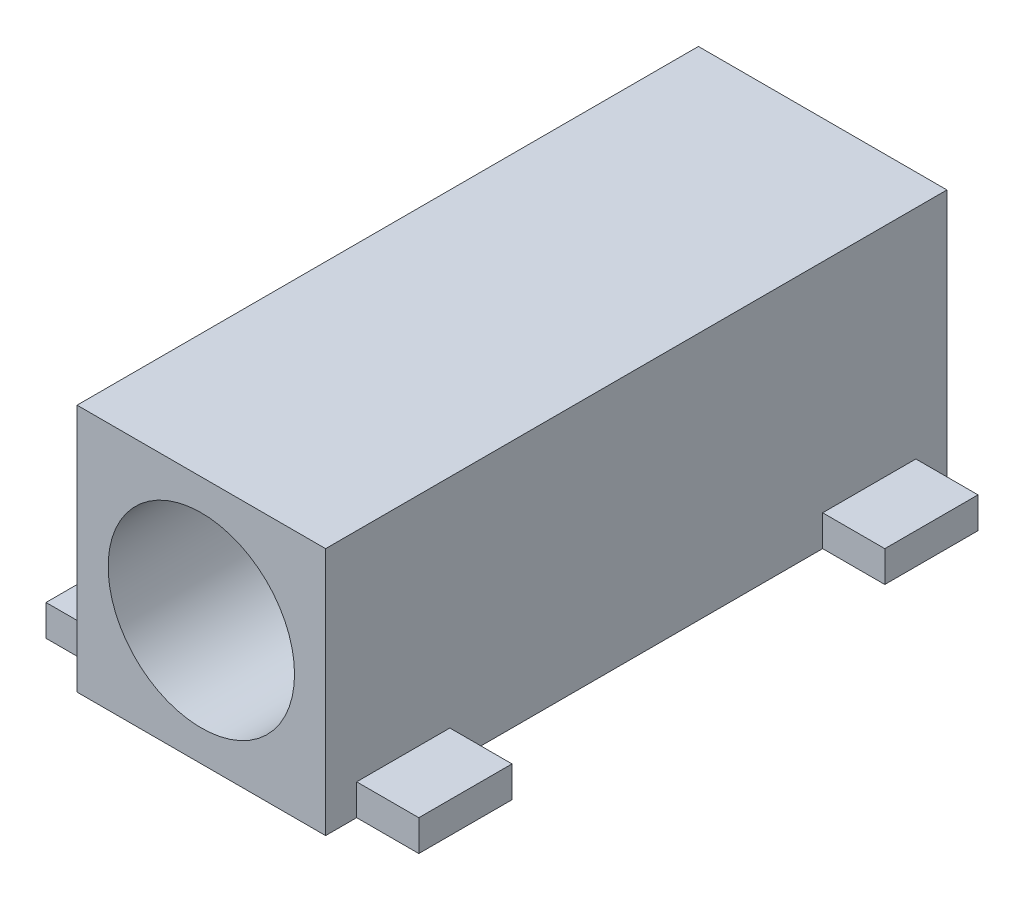
ISO-10303-21;
HEADER;
FILE_DESCRIPTION(('STEP AP214'),'2;1');
FILE_NAME('part.step','',(''),(''),'','','');
FILE_SCHEMA(('AUTOMOTIVE_DESIGN { 1 0 10303 214 1 1 1 1 }'));
ENDSEC;
DATA;
#1=APPLICATION_CONTEXT('core data for automotive mechanical design processes');
#2=APPLICATION_PROTOCOL_DEFINITION('international standard','automotive_design',2000,#1);
#3=PRODUCT_CONTEXT('',#1,'mechanical');
#4=PRODUCT('Part','Part','',(#3));
#5=PRODUCT_RELATED_PRODUCT_CATEGORY('part','',(#4));
#6=PRODUCT_DEFINITION_FORMATION('','',#4);
#7=PRODUCT_DEFINITION_CONTEXT('part definition',#1,'design');
#8=PRODUCT_DEFINITION('design','',#6,#7);
#9=PRODUCT_DEFINITION_SHAPE('','',#8);
#10=(LENGTH_UNIT() NAMED_UNIT(*) SI_UNIT(.MILLI.,.METRE.));
#11=(NAMED_UNIT(*) PLANE_ANGLE_UNIT() SI_UNIT($,.RADIAN.));
#12=(NAMED_UNIT(*) SI_UNIT($,.STERADIAN.) SOLID_ANGLE_UNIT());
#13=UNCERTAINTY_MEASURE_WITH_UNIT(LENGTH_MEASURE(1.E-05),#10,'distance_accuracy_value','');
#14=(GEOMETRIC_REPRESENTATION_CONTEXT(3) GLOBAL_UNCERTAINTY_ASSIGNED_CONTEXT((#13)) GLOBAL_UNIT_ASSIGNED_CONTEXT((#10,
#11,#12)) REPRESENTATION_CONTEXT('',''));
#15=CARTESIAN_POINT('',(0.,0.,0.));
#16=DIRECTION('',(0.,0.,1.));
#17=DIRECTION('',(1.,0.,0.));
#18=AXIS2_PLACEMENT_3D('',#15,#16,#17);
#19=CARTESIAN_POINT('',(-2.,2.,10.));
#20=DIRECTION('',(1.,0.,0.));
#21=DIRECTION('',(0.,0.,-1.));
#22=AXIS2_PLACEMENT_3D('',#19,#20,#21);
#23=PLANE('',#22);
#24=DIRECTION('',(0.,1.,0.));
#25=VECTOR('',#24,1.);
#26=CARTESIAN_POINT('',(-2.,-2.,9.5));
#27=LINE('',#26,#25);
#28=CARTESIAN_POINT('',(-2.,-2.,9.5));
#29=VERTEX_POINT('',#28);
#30=CARTESIAN_POINT('',(-2.,-1.5,9.5));
#31=VERTEX_POINT('',#30);
#32=EDGE_CURVE('E167',#29,#31,#27,.T.);
#33=ORIENTED_EDGE('',*,*,#32,.F.);
#34=DIRECTION('',(0.,0.,-1.));
#35=VECTOR('',#34,1.);
#36=CARTESIAN_POINT('',(-2.,-2.,10.));
#37=LINE('',#36,#35);
#38=CARTESIAN_POINT('',(-2.,-2.,10.));
#39=VERTEX_POINT('',#38);
#40=EDGE_CURVE('E11',#39,#29,#37,.T.);
#41=ORIENTED_EDGE('',*,*,#40,.F.);
#42=DIRECTION('',(0.,-1.,0.));
#43=VECTOR('',#42,1.);
#44=CARTESIAN_POINT('',(-2.,2.,10.));
#45=LINE('',#44,#43);
#46=CARTESIAN_POINT('',(-2.,2.,10.));
#47=VERTEX_POINT('',#46);
#48=EDGE_CURVE('E288',#47,#39,#45,.T.);
#49=ORIENTED_EDGE('',*,*,#48,.F.);
#50=DIRECTION('',(0.,0.,-1.));
#51=VECTOR('',#50,1.);
#52=CARTESIAN_POINT('',(-2.,2.,10.));
#53=LINE('',#52,#51);
#54=CARTESIAN_POINT('',(-2.,2.,0.));
#55=VERTEX_POINT('',#54);
#56=EDGE_CURVE('E283',#47,#55,#53,.T.);
#57=ORIENTED_EDGE('',*,*,#56,.T.);
#58=DIRECTION('',(0.,-1.,0.));
#59=VECTOR('',#58,1.);
#60=CARTESIAN_POINT('',(-2.,2.,0.));
#61=LINE('',#60,#59);
#62=CARTESIAN_POINT('',(-2.,-2.,0.));
#63=VERTEX_POINT('',#62);
#64=EDGE_CURVE('E287',#55,#63,#61,.T.);
#65=ORIENTED_EDGE('',*,*,#64,.T.);
#66=CARTESIAN_POINT('',(-2.,-2.,8.));
#67=VERTEX_POINT('',#66);
#68=EDGE_CURVE('E41',#67,#63,#37,.T.);
#69=ORIENTED_EDGE('',*,*,#68,.F.);
#70=DIRECTION('',(0.,-1.,0.));
#71=VECTOR('',#70,1.);
#72=CARTESIAN_POINT('',(-2.,-2.,8.));
#73=LINE('',#72,#71);
#74=CARTESIAN_POINT('',(-2.,-1.5,8.));
#75=VERTEX_POINT('',#74);
#76=EDGE_CURVE('E164',#75,#67,#73,.T.);
#77=ORIENTED_EDGE('',*,*,#76,.F.);
#78=DIRECTION('',(0.,0.,-1.));
#79=VECTOR('',#78,1.);
#80=CARTESIAN_POINT('',(-2.,-1.5,9.5));
#81=LINE('',#80,#79);
#82=EDGE_CURVE('E49',#31,#75,#81,.T.);
#83=ORIENTED_EDGE('',*,*,#82,.F.);
#84=EDGE_LOOP('',(#33,#41,#49,#57,#65,#69,#77,#83));
#85=FACE_BOUND('',#84,.T.);
#86=ADVANCED_FACE('F33',(#85),#23,.F.);
#87=CARTESIAN_POINT('',(2.,2.,10.));
#88=DIRECTION('',(-1.,0.,0.));
#89=DIRECTION('',(0.,0.,1.));
#90=AXIS2_PLACEMENT_3D('',#87,#88,#89);
#91=PLANE('',#90);
#92=DIRECTION('',(0.,-1.,0.));
#93=VECTOR('',#92,1.);
#94=CARTESIAN_POINT('',(2.,-2.,2.));
#95=LINE('',#94,#93);
#96=CARTESIAN_POINT('',(2.,-1.5,2.));
#97=VERTEX_POINT('',#96);
#98=CARTESIAN_POINT('',(2.,-2.,2.));
#99=VERTEX_POINT('',#98);
#100=EDGE_CURVE('E168',#97,#99,#95,.T.);
#101=ORIENTED_EDGE('',*,*,#100,.F.);
#102=DIRECTION('',(0.,0.,1.));
#103=VECTOR('',#102,1.);
#104=CARTESIAN_POINT('',(2.,-1.5,2.));
#105=LINE('',#104,#103);
#106=CARTESIAN_POINT('',(2.,-1.5,0.5));
#107=VERTEX_POINT('',#106);
#108=EDGE_CURVE('E181',#107,#97,#105,.T.);
#109=ORIENTED_EDGE('',*,*,#108,.F.);
#110=DIRECTION('',(0.,1.,0.));
#111=VECTOR('',#110,1.);
#112=CARTESIAN_POINT('',(2.,-2.,0.5));
#113=LINE('',#112,#111);
#114=CARTESIAN_POINT('',(2.,-2.,0.5));
#115=VERTEX_POINT('',#114);
#116=EDGE_CURVE('E171',#115,#107,#113,.T.);
#117=ORIENTED_EDGE('',*,*,#116,.F.);
#118=DIRECTION('',(0.,0.,-1.));
#119=VECTOR('',#118,1.);
#120=CARTESIAN_POINT('',(2.,-2.,10.));
#121=LINE('',#120,#119);
#122=CARTESIAN_POINT('',(2.,-2.,0.));
#123=VERTEX_POINT('',#122);
#124=EDGE_CURVE('E225',#115,#123,#121,.T.);
#125=ORIENTED_EDGE('',*,*,#124,.T.);
#126=DIRECTION('',(0.,1.,0.));
#127=VECTOR('',#126,1.);
#128=CARTESIAN_POINT('',(2.,2.,0.));
#129=LINE('',#128,#127);
#130=CARTESIAN_POINT('',(2.,2.,0.));
#131=VERTEX_POINT('',#130);
#132=EDGE_CURVE('E271',#123,#131,#129,.T.);
#133=ORIENTED_EDGE('',*,*,#132,.T.);
#134=DIRECTION('',(0.,0.,-1.));
#135=VECTOR('',#134,1.);
#136=CARTESIAN_POINT('',(2.,2.,10.));
#137=LINE('',#136,#135);
#138=CARTESIAN_POINT('',(2.,2.,10.));
#139=VERTEX_POINT('',#138);
#140=EDGE_CURVE('E228',#139,#131,#137,.T.);
#141=ORIENTED_EDGE('',*,*,#140,.F.);
#142=DIRECTION('',(0.,1.,0.));
#143=VECTOR('',#142,1.);
#144=CARTESIAN_POINT('',(2.,2.,10.));
#145=LINE('',#144,#143);
#146=CARTESIAN_POINT('',(2.,-2.,10.));
#147=VERTEX_POINT('',#146);
#148=EDGE_CURVE('E295',#147,#139,#145,.T.);
#149=ORIENTED_EDGE('',*,*,#148,.F.);
#150=CARTESIAN_POINT('',(2.,-2.,9.5));
#151=VERTEX_POINT('',#150);
#152=EDGE_CURVE('E240',#147,#151,#121,.T.);
#153=ORIENTED_EDGE('',*,*,#152,.T.);
#154=DIRECTION('',(0.,-1.,0.));
#155=VECTOR('',#154,1.);
#156=CARTESIAN_POINT('',(2.,-2.,9.5));
#157=LINE('',#156,#155);
#158=CARTESIAN_POINT('',(2.,-1.5,9.5));
#159=VERTEX_POINT('',#158);
#160=EDGE_CURVE('E203',#159,#151,#157,.T.);
#161=ORIENTED_EDGE('',*,*,#160,.F.);
#162=DIRECTION('',(0.,0.,1.));
#163=VECTOR('',#162,1.);
#164=CARTESIAN_POINT('',(2.,-1.5,9.5));
#165=LINE('',#164,#163);
#166=CARTESIAN_POINT('',(2.,-1.5,8.));
#167=VERTEX_POINT('',#166);
#168=EDGE_CURVE('E208',#167,#159,#165,.T.);
#169=ORIENTED_EDGE('',*,*,#168,.F.);
#170=DIRECTION('',(0.,1.,0.));
#171=VECTOR('',#170,1.);
#172=CARTESIAN_POINT('',(2.,-2.,8.));
#173=LINE('',#172,#171);
#174=CARTESIAN_POINT('',(2.,-2.,8.));
#175=VERTEX_POINT('',#174);
#176=EDGE_CURVE('E222',#175,#167,#173,.T.);
#177=ORIENTED_EDGE('',*,*,#176,.F.);
#178=EDGE_CURVE('E227',#175,#99,#121,.T.);
#179=ORIENTED_EDGE('',*,*,#178,.T.);
#180=EDGE_LOOP('',(#101,#109,#117,#125,#133,#141,#149,#153,#161,#169,#177,#179));
#181=FACE_BOUND('',#180,.T.);
#182=ADVANCED_FACE('F246',(#181),#91,.F.);
#183=CARTESIAN_POINT('',(0.,0.,10.));
#184=DIRECTION('',(0.,0.,1.));
#185=DIRECTION('',(1.,0.,0.));
#186=AXIS2_PLACEMENT_3D('',#183,#184,#185);
#187=PLANE('',#186);
#188=ORIENTED_EDGE('',*,*,#48,.T.);
#189=DIRECTION('',(1.,0.,0.));
#190=VECTOR('',#189,1.);
#191=CARTESIAN_POINT('',(-2.,-2.,10.));
#192=LINE('',#191,#190);
#193=EDGE_CURVE('E291',#39,#147,#192,.T.);
#194=ORIENTED_EDGE('',*,*,#193,.T.);
#195=ORIENTED_EDGE('',*,*,#148,.T.);
#196=DIRECTION('',(-1.,0.,0.));
#197=VECTOR('',#196,1.);
#198=CARTESIAN_POINT('',(-2.,2.,10.));
#199=LINE('',#198,#197);
#200=EDGE_CURVE('E282',#139,#47,#199,.T.);
#201=ORIENTED_EDGE('',*,*,#200,.T.);
#202=EDGE_LOOP('',(#188,#194,#195,#201));
#203=FACE_BOUND('',#202,.T.);
#204=CARTESIAN_POINT('',(0.,0.,10.));
#205=DIRECTION('',(0.,0.,1.));
#206=DIRECTION('',(1.,0.,0.));
#207=AXIS2_PLACEMENT_3D('',#204,#205,#206);
#208=CIRCLE('',#207,1.5);
#209=CARTESIAN_POINT('',(1.5,0.,10.));
#210=VERTEX_POINT('',#209);
#211=EDGE_CURVE('E301',#210,#210,#208,.T.);
#212=ORIENTED_EDGE('',*,*,#211,.F.);
#213=EDGE_LOOP('',(#212));
#214=FACE_BOUND('',#213,.T.);
#215=ADVANCED_FACE('F312',(#203,#214),#187,.T.);
#216=CARTESIAN_POINT('',(0.,0.,0.));
#217=DIRECTION('',(0.,0.,1.));
#218=DIRECTION('',(1.,0.,0.));
#219=AXIS2_PLACEMENT_3D('',#216,#217,#218);
#220=PLANE('',#219);
#221=ORIENTED_EDGE('',*,*,#64,.F.);
#222=DIRECTION('',(-1.,0.,0.));
#223=VECTOR('',#222,1.);
#224=CARTESIAN_POINT('',(-2.,2.,0.));
#225=LINE('',#224,#223);
#226=EDGE_CURVE('E276',#131,#55,#225,.T.);
#227=ORIENTED_EDGE('',*,*,#226,.F.);
#228=ORIENTED_EDGE('',*,*,#132,.F.);
#229=DIRECTION('',(1.,0.,0.));
#230=VECTOR('',#229,1.);
#231=CARTESIAN_POINT('',(-2.,-2.,0.));
#232=LINE('',#231,#230);
#233=EDGE_CURVE('E268',#63,#123,#232,.T.);
#234=ORIENTED_EDGE('',*,*,#233,.F.);
#235=EDGE_LOOP('',(#221,#227,#228,#234));
#236=FACE_BOUND('',#235,.T.);
#237=CARTESIAN_POINT('',(0.,0.,0.));
#238=DIRECTION('',(0.,0.,1.));
#239=DIRECTION('',(1.,0.,0.));
#240=AXIS2_PLACEMENT_3D('',#237,#238,#239);
#241=CIRCLE('',#240,1.5);
#242=CARTESIAN_POINT('',(1.5,0.,0.));
#243=VERTEX_POINT('',#242);
#244=EDGE_CURVE('E303',#243,#243,#241,.T.);
#245=ORIENTED_EDGE('',*,*,#244,.T.);
#246=EDGE_LOOP('',(#245));
#247=FACE_BOUND('',#246,.T.);
#248=ADVANCED_FACE('F285',(#236,#247),#220,.F.);
#249=CARTESIAN_POINT('',(-2.,-2.,10.));
#250=DIRECTION('',(0.,1.,0.));
#251=DIRECTION('',(0.,0.,1.));
#252=AXIS2_PLACEMENT_3D('',#249,#250,#251);
#253=PLANE('',#252);
#254=ORIENTED_EDGE('',*,*,#233,.T.);
#255=ORIENTED_EDGE('',*,*,#124,.F.);
#256=DIRECTION('',(-1.,0.,0.));
#257=VECTOR('',#256,1.);
#258=CARTESIAN_POINT('',(3.,-2.,0.5));
#259=LINE('',#258,#257);
#260=CARTESIAN_POINT('',(3.,-2.,0.5));
#261=VERTEX_POINT('',#260);
#262=EDGE_CURVE('E197',#261,#115,#259,.T.);
#263=ORIENTED_EDGE('',*,*,#262,.F.);
#264=DIRECTION('',(0.,0.,-1.));
#265=VECTOR('',#264,1.);
#266=CARTESIAN_POINT('',(3.,-2.,2.));
#267=LINE('',#266,#265);
#268=CARTESIAN_POINT('',(3.,-2.,2.));
#269=VERTEX_POINT('',#268);
#270=EDGE_CURVE('E180',#269,#261,#267,.T.);
#271=ORIENTED_EDGE('',*,*,#270,.F.);
#272=DIRECTION('',(-1.,0.,0.));
#273=VECTOR('',#272,1.);
#274=CARTESIAN_POINT('',(3.,-2.,2.));
#275=LINE('',#274,#273);
#276=EDGE_CURVE('E200',#269,#99,#275,.T.);
#277=ORIENTED_EDGE('',*,*,#276,.T.);
#278=ORIENTED_EDGE('',*,*,#178,.F.);
#279=DIRECTION('',(-1.,0.,0.));
#280=VECTOR('',#279,1.);
#281=CARTESIAN_POINT('',(3.,-2.,8.));
#282=LINE('',#281,#280);
#283=CARTESIAN_POINT('',(3.,-2.,8.));
#284=VERTEX_POINT('',#283);
#285=EDGE_CURVE('E318',#284,#175,#282,.T.);
#286=ORIENTED_EDGE('',*,*,#285,.F.);
#287=DIRECTION('',(0.,0.,-1.));
#288=VECTOR('',#287,1.);
#289=CARTESIAN_POINT('',(3.,-2.,9.5));
#290=LINE('',#289,#288);
#291=CARTESIAN_POINT('',(3.,-2.,9.5));
#292=VERTEX_POINT('',#291);
#293=EDGE_CURVE('E207',#292,#284,#290,.T.);
#294=ORIENTED_EDGE('',*,*,#293,.F.);
#295=DIRECTION('',(-1.,0.,0.));
#296=VECTOR('',#295,1.);
#297=CARTESIAN_POINT('',(3.,-2.,9.5));
#298=LINE('',#297,#296);
#299=EDGE_CURVE('E308',#292,#151,#298,.T.);
#300=ORIENTED_EDGE('',*,*,#299,.T.);
#301=ORIENTED_EDGE('',*,*,#152,.F.);
#302=ORIENTED_EDGE('',*,*,#193,.F.);
#303=ORIENTED_EDGE('',*,*,#40,.T.);
#304=DIRECTION('',(1.,0.,0.));
#305=VECTOR('',#304,1.);
#306=CARTESIAN_POINT('',(-3.,-2.,9.5));
#307=LINE('',#306,#305);
#308=CARTESIAN_POINT('',(-3.,-2.,9.5));
#309=VERTEX_POINT('',#308);
#310=EDGE_CURVE('E352',#309,#29,#307,.T.);
#311=ORIENTED_EDGE('',*,*,#310,.F.);
#312=DIRECTION('',(0.,0.,1.));
#313=VECTOR('',#312,1.);
#314=CARTESIAN_POINT('',(-3.,-2.,9.5));
#315=LINE('',#314,#313);
#316=CARTESIAN_POINT('',(-3.,-2.,8.));
#317=VERTEX_POINT('',#316);
#318=EDGE_CURVE('E160',#317,#309,#315,.T.);
#319=ORIENTED_EDGE('',*,*,#318,.F.);
#320=DIRECTION('',(1.,0.,0.));
#321=VECTOR('',#320,1.);
#322=CARTESIAN_POINT('',(-3.,-2.,8.));
#323=LINE('',#322,#321);
#324=EDGE_CURVE('E173',#317,#67,#323,.T.);
#325=ORIENTED_EDGE('',*,*,#324,.T.);
#326=ORIENTED_EDGE('',*,*,#68,.T.);
#327=EDGE_LOOP('',(#254,#255,#263,#271,#277,#278,#286,#294,#300,#301,#302,#303,#311,#319,#325,#326));
#328=FACE_BOUND('',#327,.T.);
#329=ADVANCED_FACE('F253',(#328),#253,.F.);
#330=CARTESIAN_POINT('',(-2.,2.,10.));
#331=DIRECTION('',(0.,-1.,0.));
#332=DIRECTION('',(1.,0.,0.));
#333=AXIS2_PLACEMENT_3D('',#330,#331,#332);
#334=PLANE('',#333);
#335=ORIENTED_EDGE('',*,*,#226,.T.);
#336=ORIENTED_EDGE('',*,*,#56,.F.);
#337=ORIENTED_EDGE('',*,*,#200,.F.);
#338=ORIENTED_EDGE('',*,*,#140,.T.);
#339=EDGE_LOOP('',(#335,#336,#337,#338));
#340=FACE_BOUND('',#339,.T.);
#341=ADVANCED_FACE('F279',(#340),#334,.F.);
#342=CARTESIAN_POINT('',(0.,0.,10.));
#343=DIRECTION('',(0.,0.,-1.));
#344=DIRECTION('',(-1.,0.,0.));
#345=AXIS2_PLACEMENT_3D('',#342,#343,#344);
#346=CYLINDRICAL_SURFACE('',#345,1.5);
#347=ORIENTED_EDGE('',*,*,#211,.T.);
#348=EDGE_LOOP('',(#347));
#349=FACE_BOUND('',#348,.T.);
#350=ORIENTED_EDGE('',*,*,#244,.F.);
#351=EDGE_LOOP('',(#350));
#352=FACE_BOUND('',#351,.T.);
#353=ADVANCED_FACE('F466',(#349,#352),#346,.F.);
#354=CARTESIAN_POINT('',(3.,-2.,9.5));
#355=DIRECTION('',(0.,0.,-1.));
#356=DIRECTION('',(-1.,0.,0.));
#357=AXIS2_PLACEMENT_3D('',#354,#355,#356);
#358=PLANE('',#357);
#359=ORIENTED_EDGE('',*,*,#160,.T.);
#360=ORIENTED_EDGE('',*,*,#299,.F.);
#361=DIRECTION('',(0.,-1.,0.));
#362=VECTOR('',#361,1.);
#363=CARTESIAN_POINT('',(3.,-2.,9.5));
#364=LINE('',#363,#362);
#365=CARTESIAN_POINT('',(3.,-1.5,9.5));
#366=VERTEX_POINT('',#365);
#367=EDGE_CURVE('E204',#366,#292,#364,.T.);
#368=ORIENTED_EDGE('',*,*,#367,.F.);
#369=DIRECTION('',(-1.,0.,0.));
#370=VECTOR('',#369,1.);
#371=CARTESIAN_POINT('',(3.,-1.5,9.5));
#372=LINE('',#371,#370);
#373=EDGE_CURVE('E214',#366,#159,#372,.T.);
#374=ORIENTED_EDGE('',*,*,#373,.T.);
#375=EDGE_LOOP('',(#359,#360,#368,#374));
#376=FACE_BOUND('',#375,.T.);
#377=ADVANCED_FACE('F320',(#376),#358,.F.);
#378=CARTESIAN_POINT('',(3.,-2.,8.));
#379=DIRECTION('',(0.,0.,1.));
#380=DIRECTION('',(1.,0.,0.));
#381=AXIS2_PLACEMENT_3D('',#378,#379,#380);
#382=PLANE('',#381);
#383=ORIENTED_EDGE('',*,*,#176,.T.);
#384=DIRECTION('',(-1.,0.,0.));
#385=VECTOR('',#384,1.);
#386=CARTESIAN_POINT('',(3.,-1.5,8.));
#387=LINE('',#386,#385);
#388=CARTESIAN_POINT('',(3.,-1.5,8.));
#389=VERTEX_POINT('',#388);
#390=EDGE_CURVE('E311',#389,#167,#387,.T.);
#391=ORIENTED_EDGE('',*,*,#390,.F.);
#392=DIRECTION('',(0.,1.,0.));
#393=VECTOR('',#392,1.);
#394=CARTESIAN_POINT('',(3.,-2.,8.));
#395=LINE('',#394,#393);
#396=EDGE_CURVE('E210',#284,#389,#395,.T.);
#397=ORIENTED_EDGE('',*,*,#396,.F.);
#398=ORIENTED_EDGE('',*,*,#285,.T.);
#399=EDGE_LOOP('',(#383,#391,#397,#398));
#400=FACE_BOUND('',#399,.T.);
#401=ADVANCED_FACE('F335',(#400),#382,.F.);
#402=CARTESIAN_POINT('',(3.,-1.5,9.5));
#403=DIRECTION('',(0.,-1.,0.));
#404=DIRECTION('',(0.,0.,-1.));
#405=AXIS2_PLACEMENT_3D('',#402,#403,#404);
#406=PLANE('',#405);
#407=ORIENTED_EDGE('',*,*,#168,.T.);
#408=ORIENTED_EDGE('',*,*,#373,.F.);
#409=DIRECTION('',(0.,0.,1.));
#410=VECTOR('',#409,1.);
#411=CARTESIAN_POINT('',(3.,-1.5,9.5));
#412=LINE('',#411,#410);
#413=EDGE_CURVE('E212',#389,#366,#412,.T.);
#414=ORIENTED_EDGE('',*,*,#413,.F.);
#415=ORIENTED_EDGE('',*,*,#390,.T.);
#416=EDGE_LOOP('',(#407,#408,#414,#415));
#417=FACE_BOUND('',#416,.T.);
#418=ADVANCED_FACE('F325',(#417),#406,.F.);
#419=CARTESIAN_POINT('',(3.,0.,0.));
#420=DIRECTION('',(-1.,0.,0.));
#421=DIRECTION('',(0.,0.,1.));
#422=AXIS2_PLACEMENT_3D('',#419,#420,#421);
#423=PLANE('',#422);
#424=ORIENTED_EDGE('',*,*,#367,.T.);
#425=ORIENTED_EDGE('',*,*,#293,.T.);
#426=ORIENTED_EDGE('',*,*,#396,.T.);
#427=ORIENTED_EDGE('',*,*,#413,.T.);
#428=EDGE_LOOP('',(#424,#425,#426,#427));
#429=FACE_BOUND('',#428,.T.);
#430=ADVANCED_FACE('F337',(#429),#423,.F.);
#431=CARTESIAN_POINT('',(3.,-2.,2.));
#432=DIRECTION('',(0.,0.,-1.));
#433=DIRECTION('',(0.,1.,0.));
#434=AXIS2_PLACEMENT_3D('',#431,#432,#433);
#435=PLANE('',#434);
#436=ORIENTED_EDGE('',*,*,#100,.T.);
#437=ORIENTED_EDGE('',*,*,#276,.F.);
#438=DIRECTION('',(0.,-1.,0.));
#439=VECTOR('',#438,1.);
#440=CARTESIAN_POINT('',(3.,-2.,2.));
#441=LINE('',#440,#439);
#442=CARTESIAN_POINT('',(3.,-1.5,2.));
#443=VERTEX_POINT('',#442);
#444=EDGE_CURVE('E177',#443,#269,#441,.T.);
#445=ORIENTED_EDGE('',*,*,#444,.F.);
#446=DIRECTION('',(-1.,0.,0.));
#447=VECTOR('',#446,1.);
#448=CARTESIAN_POINT('',(3.,-1.5,2.));
#449=LINE('',#448,#447);
#450=EDGE_CURVE('E186',#443,#97,#449,.T.);
#451=ORIENTED_EDGE('',*,*,#450,.T.);
#452=EDGE_LOOP('',(#436,#437,#445,#451));
#453=FACE_BOUND('',#452,.T.);
#454=ADVANCED_FACE('F257',(#453),#435,.F.);
#455=CARTESIAN_POINT('',(3.,-2.,0.5));
#456=DIRECTION('',(0.,0.,1.));
#457=DIRECTION('',(1.,0.,0.));
#458=AXIS2_PLACEMENT_3D('',#455,#456,#457);
#459=PLANE('',#458);
#460=ORIENTED_EDGE('',*,*,#116,.T.);
#461=DIRECTION('',(-1.,0.,0.));
#462=VECTOR('',#461,1.);
#463=CARTESIAN_POINT('',(3.,-1.5,0.5));
#464=LINE('',#463,#462);
#465=CARTESIAN_POINT('',(3.,-1.5,0.5));
#466=VERTEX_POINT('',#465);
#467=EDGE_CURVE('E194',#466,#107,#464,.T.);
#468=ORIENTED_EDGE('',*,*,#467,.F.);
#469=DIRECTION('',(0.,1.,0.));
#470=VECTOR('',#469,1.);
#471=CARTESIAN_POINT('',(3.,-2.,0.5));
#472=LINE('',#471,#470);
#473=EDGE_CURVE('E183',#261,#466,#472,.T.);
#474=ORIENTED_EDGE('',*,*,#473,.F.);
#475=ORIENTED_EDGE('',*,*,#262,.T.);
#476=EDGE_LOOP('',(#460,#468,#474,#475));
#477=FACE_BOUND('',#476,.T.);
#478=ADVANCED_FACE('F265',(#477),#459,.F.);
#479=CARTESIAN_POINT('',(3.,-1.5,2.));
#480=DIRECTION('',(0.,-1.,0.));
#481=DIRECTION('',(0.,0.,-1.));
#482=AXIS2_PLACEMENT_3D('',#479,#480,#481);
#483=PLANE('',#482);
#484=ORIENTED_EDGE('',*,*,#108,.T.);
#485=ORIENTED_EDGE('',*,*,#450,.F.);
#486=DIRECTION('',(0.,0.,1.));
#487=VECTOR('',#486,1.);
#488=CARTESIAN_POINT('',(3.,-1.5,2.));
#489=LINE('',#488,#487);
#490=EDGE_CURVE('E185',#466,#443,#489,.T.);
#491=ORIENTED_EDGE('',*,*,#490,.F.);
#492=ORIENTED_EDGE('',*,*,#467,.T.);
#493=EDGE_LOOP('',(#484,#485,#491,#492));
#494=FACE_BOUND('',#493,.T.);
#495=ADVANCED_FACE('F261',(#494),#483,.F.);
#496=CARTESIAN_POINT('',(3.,0.,0.));
#497=DIRECTION('',(-1.,0.,0.));
#498=DIRECTION('',(0.,0.,1.));
#499=AXIS2_PLACEMENT_3D('',#496,#497,#498);
#500=PLANE('',#499);
#501=ORIENTED_EDGE('',*,*,#444,.T.);
#502=ORIENTED_EDGE('',*,*,#270,.T.);
#503=ORIENTED_EDGE('',*,*,#473,.T.);
#504=ORIENTED_EDGE('',*,*,#490,.T.);
#505=EDGE_LOOP('',(#501,#502,#503,#504));
#506=FACE_BOUND('',#505,.T.);
#507=ADVANCED_FACE('F378',(#506),#500,.F.);
#508=CARTESIAN_POINT('',(-3.,-2.,9.5));
#509=DIRECTION('',(0.,0.,-1.));
#510=DIRECTION('',(-1.,0.,0.));
#511=AXIS2_PLACEMENT_3D('',#508,#509,#510);
#512=PLANE('',#511);
#513=ORIENTED_EDGE('',*,*,#32,.T.);
#514=DIRECTION('',(1.,0.,0.));
#515=VECTOR('',#514,1.);
#516=CARTESIAN_POINT('',(-3.,-1.5,9.5));
#517=LINE('',#516,#515);
#518=CARTESIAN_POINT('',(-3.,-1.5,9.5));
#519=VERTEX_POINT('',#518);
#520=EDGE_CURVE('E148',#519,#31,#517,.T.);
#521=ORIENTED_EDGE('',*,*,#520,.F.);
#522=DIRECTION('',(0.,1.,0.));
#523=VECTOR('',#522,1.);
#524=CARTESIAN_POINT('',(-3.,-2.,9.5));
#525=LINE('',#524,#523);
#526=EDGE_CURVE('E155',#309,#519,#525,.T.);
#527=ORIENTED_EDGE('',*,*,#526,.F.);
#528=ORIENTED_EDGE('',*,*,#310,.T.);
#529=EDGE_LOOP('',(#513,#521,#527,#528));
#530=FACE_BOUND('',#529,.T.);
#531=ADVANCED_FACE('F166',(#530),#512,.F.);
#532=CARTESIAN_POINT('',(-3.,-1.5,9.5));
#533=DIRECTION('',(0.,-1.,0.));
#534=DIRECTION('',(0.,0.,-1.));
#535=AXIS2_PLACEMENT_3D('',#532,#533,#534);
#536=PLANE('',#535);
#537=ORIENTED_EDGE('',*,*,#82,.T.);
#538=DIRECTION('',(1.,0.,0.));
#539=VECTOR('',#538,1.);
#540=CARTESIAN_POINT('',(-3.,-1.5,8.));
#541=LINE('',#540,#539);
#542=CARTESIAN_POINT('',(-3.,-1.5,8.));
#543=VERTEX_POINT('',#542);
#544=EDGE_CURVE('E151',#543,#75,#541,.T.);
#545=ORIENTED_EDGE('',*,*,#544,.F.);
#546=DIRECTION('',(0.,0.,-1.));
#547=VECTOR('',#546,1.);
#548=CARTESIAN_POINT('',(-3.,-1.5,9.5));
#549=LINE('',#548,#547);
#550=EDGE_CURVE('E144',#519,#543,#549,.T.);
#551=ORIENTED_EDGE('',*,*,#550,.F.);
#552=ORIENTED_EDGE('',*,*,#520,.T.);
#553=EDGE_LOOP('',(#537,#545,#551,#552));
#554=FACE_BOUND('',#553,.T.);
#555=ADVANCED_FACE('F146',(#554),#536,.F.);
#556=CARTESIAN_POINT('',(-3.,-2.,8.));
#557=DIRECTION('',(0.,0.,1.));
#558=DIRECTION('',(1.,0.,0.));
#559=AXIS2_PLACEMENT_3D('',#556,#557,#558);
#560=PLANE('',#559);
#561=ORIENTED_EDGE('',*,*,#76,.T.);
#562=ORIENTED_EDGE('',*,*,#324,.F.);
#563=DIRECTION('',(0.,-1.,0.));
#564=VECTOR('',#563,1.);
#565=CARTESIAN_POINT('',(-3.,-2.,8.));
#566=LINE('',#565,#564);
#567=EDGE_CURVE('E154',#543,#317,#566,.T.);
#568=ORIENTED_EDGE('',*,*,#567,.F.);
#569=ORIENTED_EDGE('',*,*,#544,.T.);
#570=EDGE_LOOP('',(#561,#562,#568,#569));
#571=FACE_BOUND('',#570,.T.);
#572=ADVANCED_FACE('F366',(#571),#560,.F.);
#573=CARTESIAN_POINT('',(-3.,0.,0.));
#574=DIRECTION('',(-1.,0.,0.));
#575=DIRECTION('',(0.,0.,1.));
#576=AXIS2_PLACEMENT_3D('',#573,#574,#575);
#577=PLANE('',#576);
#578=ORIENTED_EDGE('',*,*,#526,.T.);
#579=ORIENTED_EDGE('',*,*,#550,.T.);
#580=ORIENTED_EDGE('',*,*,#567,.T.);
#581=ORIENTED_EDGE('',*,*,#318,.T.);
#582=EDGE_LOOP('',(#578,#579,#580,#581));
#583=FACE_BOUND('',#582,.T.);
#584=ADVANCED_FACE('F158',(#583),#577,.T.);
#585=CLOSED_SHELL('',(#86,#182,#215,#248,#329,#341,#353,#377,#401,#418,#430,#454,#478,#495,#507,
#531,#555,#572,#584));
#586=MANIFOLD_SOLID_BREP('B2',#585);
#587=ADVANCED_BREP_SHAPE_REPRESENTATION('',(#18,#586),#14);
#588=SHAPE_DEFINITION_REPRESENTATION(#9,#587);
ENDSEC;
END-ISO-10303-21;
